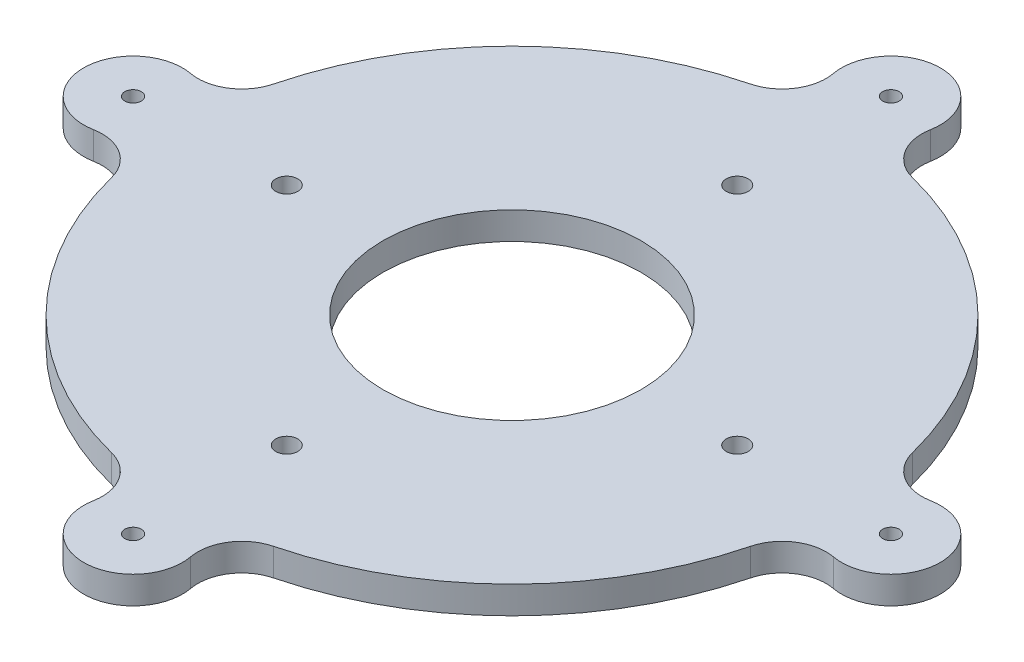
ISO-10303-21;
HEADER;
FILE_DESCRIPTION(('STEP AP214'),'2;1');
FILE_NAME('part.step','',(''),(''),'','','');
FILE_SCHEMA(('AUTOMOTIVE_DESIGN { 1 0 10303 214 1 1 1 1 }'));
ENDSEC;
DATA;
#1=APPLICATION_CONTEXT('core data for automotive mechanical design processes');
#2=APPLICATION_PROTOCOL_DEFINITION('international standard','automotive_design',2000,#1);
#3=PRODUCT_CONTEXT('',#1,'mechanical');
#4=PRODUCT('Part','Part','',(#3));
#5=PRODUCT_RELATED_PRODUCT_CATEGORY('part','',(#4));
#6=PRODUCT_DEFINITION_FORMATION('','',#4);
#7=PRODUCT_DEFINITION_CONTEXT('part definition',#1,'design');
#8=PRODUCT_DEFINITION('design','',#6,#7);
#9=PRODUCT_DEFINITION_SHAPE('','',#8);
#10=(LENGTH_UNIT() NAMED_UNIT(*) SI_UNIT(.MILLI.,.METRE.));
#11=(NAMED_UNIT(*) PLANE_ANGLE_UNIT() SI_UNIT($,.RADIAN.));
#12=(NAMED_UNIT(*) SI_UNIT($,.STERADIAN.) SOLID_ANGLE_UNIT());
#13=UNCERTAINTY_MEASURE_WITH_UNIT(LENGTH_MEASURE(1.E-05),#10,'distance_accuracy_value','');
#14=(GEOMETRIC_REPRESENTATION_CONTEXT(3) GLOBAL_UNCERTAINTY_ASSIGNED_CONTEXT((#13)) GLOBAL_UNIT_ASSIGNED_CONTEXT((#10,
#11,#12)) REPRESENTATION_CONTEXT('',''));
#15=CARTESIAN_POINT('',(0.,0.,0.));
#16=DIRECTION('',(0.,0.,1.));
#17=DIRECTION('',(1.,0.,0.));
#18=AXIS2_PLACEMENT_3D('',#15,#16,#17);
#19=CARTESIAN_POINT('',(32.9565217391304,5.,8.35868858483333));
#20=DIRECTION('',(0.,1.,0.));
#21=DIRECTION('',(0.,0.,1.));
#22=AXIS2_PLACEMENT_3D('',#19,#20,#21);
#23=PLANE('',#22);
#24=CARTESIAN_POINT('',(0.,5.,41.01219331));
#25=DIRECTION('',(0.,1.,0.));
#26=DIRECTION('',(0.,0.,1.));
#27=AXIS2_PLACEMENT_3D('',#24,#25,#26);
#28=CIRCLE('',#27,2.);
#29=CARTESIAN_POINT('',(0.,5.,43.01219331));
#30=VERTEX_POINT('',#29);
#31=EDGE_CURVE('E367',#30,#30,#28,.T.);
#32=ORIENTED_EDGE('',*,*,#31,.F.);
#33=EDGE_LOOP('',(#32));
#34=FACE_BOUND('',#33,.T.);
#35=CARTESIAN_POINT('',(-41.01219331,5.,0.));
#36=DIRECTION('',(0.,1.,0.));
#37=DIRECTION('',(0.,0.,1.));
#38=AXIS2_PLACEMENT_3D('',#35,#36,#37);
#39=CIRCLE('',#38,2.);
#40=CARTESIAN_POINT('',(-41.01219331,5.,2.));
#41=VERTEX_POINT('',#40);
#42=EDGE_CURVE('E379',#41,#41,#39,.T.);
#43=ORIENTED_EDGE('',*,*,#42,.F.);
#44=EDGE_LOOP('',(#43));
#45=FACE_BOUND('',#44,.T.);
#46=CARTESIAN_POINT('',(0.,5.,69.));
#47=DIRECTION('',(0.,1.,0.));
#48=DIRECTION('',(0.,0.,1.));
#49=AXIS2_PLACEMENT_3D('',#46,#47,#48);
#50=CIRCLE('',#49,1.5);
#51=CARTESIAN_POINT('',(0.,5.,70.5));
#52=VERTEX_POINT('',#51);
#53=EDGE_CURVE('E391',#52,#52,#50,.T.);
#54=ORIENTED_EDGE('',*,*,#53,.F.);
#55=EDGE_LOOP('',(#54));
#56=FACE_BOUND('',#55,.T.);
#57=CARTESIAN_POINT('',(69.,5.,0.));
#58=DIRECTION('',(0.,1.,0.));
#59=DIRECTION('',(0.,0.,1.));
#60=AXIS2_PLACEMENT_3D('',#57,#58,#59);
#61=CIRCLE('',#60,1.5);
#62=CARTESIAN_POINT('',(69.,5.,1.5));
#63=VERTEX_POINT('',#62);
#64=EDGE_CURVE('E403',#63,#63,#61,.T.);
#65=ORIENTED_EDGE('',*,*,#64,.F.);
#66=EDGE_LOOP('',(#65));
#67=FACE_BOUND('',#66,.T.);
#68=CARTESIAN_POINT('',(0.,5.,0.));
#69=DIRECTION('',(0.,1.,0.));
#70=DIRECTION('',(0.,0.,1.));
#71=AXIS2_PLACEMENT_3D('',#68,#69,#70);
#72=CIRCLE('',#71,60.);
#73=CARTESIAN_POINT('',(14.7506269144118,5.,58.158567774936));
#74=VERTEX_POINT('',#73);
#75=CARTESIAN_POINT('',(58.158567774936,5.,14.7506269144118));
#76=VERTEX_POINT('',#75);
#77=EDGE_CURVE('E213',#74,#76,#72,.T.);
#78=ORIENTED_EDGE('',*,*,#77,.T.);
#79=CARTESIAN_POINT('',(65.9130434782609,5.,16.7173771696667));
#80=DIRECTION('',(0.,-1.,0.));
#81=DIRECTION('',(0.,0.,1.));
#82=AXIS2_PLACEMENT_3D('',#79,#80,#81);
#83=CIRCLE('',#82,8.00000000000001);
#84=CARTESIAN_POINT('',(67.3657289002557,5.,8.85037614864705));
#85=VERTEX_POINT('',#84);
#86=EDGE_CURVE('E121',#76,#85,#83,.T.);
#87=ORIENTED_EDGE('',*,*,#86,.T.);
#88=CARTESIAN_POINT('',(69.,5.,0.));
#89=DIRECTION('',(0.,1.,0.));
#90=DIRECTION('',(0.,0.,1.));
#91=AXIS2_PLACEMENT_3D('',#88,#89,#90);
#92=CIRCLE('',#91,8.99999999999999);
#93=CARTESIAN_POINT('',(67.3657289002557,5.,-8.85037614864705));
#94=VERTEX_POINT('',#93);
#95=EDGE_CURVE('E252',#85,#94,#92,.T.);
#96=ORIENTED_EDGE('',*,*,#95,.T.);
#97=CARTESIAN_POINT('',(65.9130434782609,5.,-16.7173771696667));
#98=DIRECTION('',(0.,-1.,0.));
#99=DIRECTION('',(0.,0.,1.));
#100=AXIS2_PLACEMENT_3D('',#97,#98,#99);
#101=CIRCLE('',#100,8.00000000000001);
#102=CARTESIAN_POINT('',(58.158567774936,5.,-14.7506269144118));
#103=VERTEX_POINT('',#102);
#104=EDGE_CURVE('E271',#94,#103,#101,.T.);
#105=ORIENTED_EDGE('',*,*,#104,.T.);
#106=CARTESIAN_POINT('',(0.,5.,0.));
#107=DIRECTION('',(0.,1.,0.));
#108=DIRECTION('',(0.,0.,1.));
#109=AXIS2_PLACEMENT_3D('',#106,#107,#108);
#110=CIRCLE('',#109,60.);
#111=CARTESIAN_POINT('',(14.7506269144118,5.,-58.158567774936));
#112=VERTEX_POINT('',#111);
#113=EDGE_CURVE('E268',#103,#112,#110,.T.);
#114=ORIENTED_EDGE('',*,*,#113,.T.);
#115=CARTESIAN_POINT('',(16.7173771696667,5.,-65.9130434782609));
#116=DIRECTION('',(0.,-1.,0.));
#117=DIRECTION('',(0.,0.,1.));
#118=AXIS2_PLACEMENT_3D('',#115,#116,#117);
#119=CIRCLE('',#118,8.00000000000001);
#120=CARTESIAN_POINT('',(8.85037614864704,5.,-67.3657289002557));
#121=VERTEX_POINT('',#120);
#122=EDGE_CURVE('E270',#112,#121,#119,.T.);
#123=ORIENTED_EDGE('',*,*,#122,.T.);
#124=CARTESIAN_POINT('',(0.,5.,-69.));
#125=DIRECTION('',(0.,1.,0.));
#126=DIRECTION('',(0.,0.,1.));
#127=AXIS2_PLACEMENT_3D('',#124,#125,#126);
#128=CIRCLE('',#127,9.);
#129=CARTESIAN_POINT('',(-8.85037614864706,5.,-67.3657289002557));
#130=VERTEX_POINT('',#129);
#131=EDGE_CURVE('E273',#121,#130,#128,.T.);
#132=ORIENTED_EDGE('',*,*,#131,.T.);
#133=CARTESIAN_POINT('',(-16.7173771696667,5.,-65.9130434782609));
#134=DIRECTION('',(0.,-1.,0.));
#135=DIRECTION('',(0.,0.,1.));
#136=AXIS2_PLACEMENT_3D('',#133,#134,#135);
#137=CIRCLE('',#136,8.00000000000001);
#138=CARTESIAN_POINT('',(-14.7506269144118,5.,-58.158567774936));
#139=VERTEX_POINT('',#138);
#140=EDGE_CURVE('E279',#130,#139,#137,.T.);
#141=ORIENTED_EDGE('',*,*,#140,.T.);
#142=CARTESIAN_POINT('',(0.,5.,0.));
#143=DIRECTION('',(0.,1.,0.));
#144=DIRECTION('',(0.,0.,1.));
#145=AXIS2_PLACEMENT_3D('',#142,#143,#144);
#146=CIRCLE('',#145,60.);
#147=CARTESIAN_POINT('',(-58.158567774936,5.,-14.7506269144118));
#148=VERTEX_POINT('',#147);
#149=EDGE_CURVE('E281',#139,#148,#146,.T.);
#150=ORIENTED_EDGE('',*,*,#149,.T.);
#151=CARTESIAN_POINT('',(-65.9130434782609,5.,-16.7173771696667));
#152=DIRECTION('',(0.,-1.,0.));
#153=DIRECTION('',(0.,0.,1.));
#154=AXIS2_PLACEMENT_3D('',#151,#152,#153);
#155=CIRCLE('',#154,8.00000000000003);
#156=CARTESIAN_POINT('',(-67.3657289002558,5.,-8.85037614864703));
#157=VERTEX_POINT('',#156);
#158=EDGE_CURVE('E283',#148,#157,#155,.T.);
#159=ORIENTED_EDGE('',*,*,#158,.T.);
#160=CARTESIAN_POINT('',(-69.,5.,0.));
#161=DIRECTION('',(0.,1.,0.));
#162=DIRECTION('',(0.,0.,1.));
#163=AXIS2_PLACEMENT_3D('',#160,#161,#162);
#164=CIRCLE('',#163,8.99999999999998);
#165=CARTESIAN_POINT('',(-67.3657289002557,5.,8.85037614864704));
#166=VERTEX_POINT('',#165);
#167=EDGE_CURVE('E285',#157,#166,#164,.T.);
#168=ORIENTED_EDGE('',*,*,#167,.T.);
#169=CARTESIAN_POINT('',(-65.9130434782609,5.,16.7173771696667));
#170=DIRECTION('',(0.,-1.,0.));
#171=DIRECTION('',(0.,0.,1.));
#172=AXIS2_PLACEMENT_3D('',#169,#170,#171);
#173=CIRCLE('',#172,8.00000000000004);
#174=CARTESIAN_POINT('',(-58.158567774936,5.,14.7506269144118));
#175=VERTEX_POINT('',#174);
#176=EDGE_CURVE('E287',#166,#175,#173,.T.);
#177=ORIENTED_EDGE('',*,*,#176,.T.);
#178=CARTESIAN_POINT('',(0.,5.,0.));
#179=DIRECTION('',(0.,1.,0.));
#180=DIRECTION('',(0.,0.,1.));
#181=AXIS2_PLACEMENT_3D('',#178,#179,#180);
#182=CIRCLE('',#181,60.);
#183=CARTESIAN_POINT('',(-14.7506269144118,5.,58.158567774936));
#184=VERTEX_POINT('',#183);
#185=EDGE_CURVE('E164',#175,#184,#182,.T.);
#186=ORIENTED_EDGE('',*,*,#185,.T.);
#187=CARTESIAN_POINT('',(-16.7173771696667,5.,65.9130434782609));
#188=DIRECTION('',(0.,-1.,0.));
#189=DIRECTION('',(0.,0.,1.));
#190=AXIS2_PLACEMENT_3D('',#187,#188,#189);
#191=CIRCLE('',#190,8.00000000000002);
#192=CARTESIAN_POINT('',(-8.85037614864704,5.,67.3657289002557));
#193=VERTEX_POINT('',#192);
#194=EDGE_CURVE('E158',#184,#193,#191,.T.);
#195=ORIENTED_EDGE('',*,*,#194,.T.);
#196=CARTESIAN_POINT('',(0.,5.,69.));
#197=DIRECTION('',(0.,1.,0.));
#198=DIRECTION('',(0.,0.,1.));
#199=AXIS2_PLACEMENT_3D('',#196,#197,#198);
#200=CIRCLE('',#199,8.99999999999999);
#201=CARTESIAN_POINT('',(8.85037614864704,5.,67.3657289002557));
#202=VERTEX_POINT('',#201);
#203=EDGE_CURVE('E162',#193,#202,#200,.T.);
#204=ORIENTED_EDGE('',*,*,#203,.T.);
#205=CARTESIAN_POINT('',(16.7173771696667,5.,65.9130434782609));
#206=DIRECTION('',(0.,-1.,0.));
#207=DIRECTION('',(0.,0.,1.));
#208=AXIS2_PLACEMENT_3D('',#205,#206,#207);
#209=CIRCLE('',#208,8.00000000000002);
#210=EDGE_CURVE('E54',#202,#74,#209,.T.);
#211=ORIENTED_EDGE('',*,*,#210,.T.);
#212=EDGE_LOOP('',(#78,#87,#96,#105,#114,#123,#132,#141,#150,#159,#168,#177,#186,#195,#204,#211));
#213=FACE_BOUND('',#212,.T.);
#214=CARTESIAN_POINT('',(0.,5.,0.));
#215=DIRECTION('',(0.,1.,0.));
#216=DIRECTION('',(0.,0.,1.));
#217=AXIS2_PLACEMENT_3D('',#214,#215,#216);
#218=CIRCLE('',#217,23.5);
#219=CARTESIAN_POINT('',(0.,5.,23.5));
#220=VERTEX_POINT('',#219);
#221=EDGE_CURVE('E186',#220,#220,#218,.T.);
#222=ORIENTED_EDGE('',*,*,#221,.F.);
#223=EDGE_LOOP('',(#222));
#224=FACE_BOUND('',#223,.T.);
#225=CARTESIAN_POINT('',(0.,5.,-69.));
#226=DIRECTION('',(0.,1.,0.));
#227=DIRECTION('',(0.,0.,1.));
#228=AXIS2_PLACEMENT_3D('',#225,#226,#227);
#229=CIRCLE('',#228,1.5);
#230=CARTESIAN_POINT('',(0.,5.,-67.5));
#231=VERTEX_POINT('',#230);
#232=EDGE_CURVE('E397',#231,#231,#229,.T.);
#233=ORIENTED_EDGE('',*,*,#232,.F.);
#234=EDGE_LOOP('',(#233));
#235=FACE_BOUND('',#234,.T.);
#236=CARTESIAN_POINT('',(0.,5.,-41.01219331));
#237=DIRECTION('',(0.,1.,0.));
#238=DIRECTION('',(0.,0.,1.));
#239=AXIS2_PLACEMENT_3D('',#236,#237,#238);
#240=CIRCLE('',#239,2.00000000000001);
#241=CARTESIAN_POINT('',(0.,5.,-39.01219331));
#242=VERTEX_POINT('',#241);
#243=EDGE_CURVE('E385',#242,#242,#240,.T.);
#244=ORIENTED_EDGE('',*,*,#243,.F.);
#245=EDGE_LOOP('',(#244));
#246=FACE_BOUND('',#245,.T.);
#247=CARTESIAN_POINT('',(41.01219331,5.,0.));
#248=DIRECTION('',(0.,1.,0.));
#249=DIRECTION('',(0.,0.,1.));
#250=AXIS2_PLACEMENT_3D('',#247,#248,#249);
#251=CIRCLE('',#250,2.);
#252=CARTESIAN_POINT('',(41.01219331,5.,2.));
#253=VERTEX_POINT('',#252);
#254=EDGE_CURVE('E373',#253,#253,#251,.T.);
#255=ORIENTED_EDGE('',*,*,#254,.F.);
#256=EDGE_LOOP('',(#255));
#257=FACE_BOUND('',#256,.T.);
#258=CARTESIAN_POINT('',(-69.,5.,0.));
#259=DIRECTION('',(0.,1.,0.));
#260=DIRECTION('',(0.,0.,1.));
#261=AXIS2_PLACEMENT_3D('',#258,#259,#260);
#262=CIRCLE('',#261,1.5);
#263=CARTESIAN_POINT('',(-69.,5.,1.5));
#264=VERTEX_POINT('',#263);
#265=EDGE_CURVE('E358',#264,#264,#262,.T.);
#266=ORIENTED_EDGE('',*,*,#265,.F.);
#267=EDGE_LOOP('',(#266));
#268=FACE_BOUND('',#267,.T.);
#269=ADVANCED_FACE('F37',(#34,#45,#56,#67,#213,#224,#235,#246,#257,#268),#23,.T.);
#270=CARTESIAN_POINT('',(32.9565217391304,0.,8.35868858483333));
#271=DIRECTION('',(0.,1.,0.));
#272=DIRECTION('',(0.,0.,1.));
#273=AXIS2_PLACEMENT_3D('',#270,#271,#272);
#274=PLANE('',#273);
#275=CARTESIAN_POINT('',(0.,0.,0.));
#276=DIRECTION('',(0.,1.,0.));
#277=DIRECTION('',(0.,0.,1.));
#278=AXIS2_PLACEMENT_3D('',#275,#276,#277);
#279=CIRCLE('',#278,60.);
#280=CARTESIAN_POINT('',(14.7506269144118,0.,58.158567774936));
#281=VERTEX_POINT('',#280);
#282=CARTESIAN_POINT('',(58.158567774936,0.,14.7506269144118));
#283=VERTEX_POINT('',#282);
#284=EDGE_CURVE('E182',#281,#283,#279,.T.);
#285=ORIENTED_EDGE('',*,*,#284,.F.);
#286=CARTESIAN_POINT('',(16.7173771696667,0.,65.9130434782609));
#287=DIRECTION('',(0.,-1.,0.));
#288=DIRECTION('',(0.,0.,1.));
#289=AXIS2_PLACEMENT_3D('',#286,#287,#288);
#290=CIRCLE('',#289,8.00000000000002);
#291=CARTESIAN_POINT('',(8.85037614864704,0.,67.3657289002557));
#292=VERTEX_POINT('',#291);
#293=EDGE_CURVE('E113',#292,#281,#290,.T.);
#294=ORIENTED_EDGE('',*,*,#293,.F.);
#295=CARTESIAN_POINT('',(0.,0.,69.));
#296=DIRECTION('',(0.,1.,0.));
#297=DIRECTION('',(0.,0.,1.));
#298=AXIS2_PLACEMENT_3D('',#295,#296,#297);
#299=CIRCLE('',#298,8.99999999999999);
#300=CARTESIAN_POINT('',(-8.85037614864704,0.,67.3657289002557));
#301=VERTEX_POINT('',#300);
#302=EDGE_CURVE('E107',#301,#292,#299,.T.);
#303=ORIENTED_EDGE('',*,*,#302,.F.);
#304=CARTESIAN_POINT('',(-16.7173771696667,0.,65.9130434782609));
#305=DIRECTION('',(0.,-1.,0.));
#306=DIRECTION('',(0.,0.,1.));
#307=AXIS2_PLACEMENT_3D('',#304,#305,#306);
#308=CIRCLE('',#307,8.00000000000002);
#309=CARTESIAN_POINT('',(-14.7506269144118,0.,58.158567774936));
#310=VERTEX_POINT('',#309);
#311=EDGE_CURVE('E172',#310,#301,#308,.T.);
#312=ORIENTED_EDGE('',*,*,#311,.F.);
#313=CARTESIAN_POINT('',(0.,0.,0.));
#314=DIRECTION('',(0.,1.,0.));
#315=DIRECTION('',(0.,0.,1.));
#316=AXIS2_PLACEMENT_3D('',#313,#314,#315);
#317=CIRCLE('',#316,60.);
#318=CARTESIAN_POINT('',(-58.158567774936,0.,14.7506269144118));
#319=VERTEX_POINT('',#318);
#320=EDGE_CURVE('E208',#319,#310,#317,.T.);
#321=ORIENTED_EDGE('',*,*,#320,.F.);
#322=CARTESIAN_POINT('',(-65.9130434782609,0.,16.7173771696667));
#323=DIRECTION('',(0.,-1.,0.));
#324=DIRECTION('',(0.,0.,1.));
#325=AXIS2_PLACEMENT_3D('',#322,#323,#324);
#326=CIRCLE('',#325,8.00000000000004);
#327=CARTESIAN_POINT('',(-67.3657289002557,0.,8.85037614864704));
#328=VERTEX_POINT('',#327);
#329=EDGE_CURVE('E206',#328,#319,#326,.T.);
#330=ORIENTED_EDGE('',*,*,#329,.F.);
#331=CARTESIAN_POINT('',(-69.,0.,0.));
#332=DIRECTION('',(0.,1.,0.));
#333=DIRECTION('',(0.,0.,1.));
#334=AXIS2_PLACEMENT_3D('',#331,#332,#333);
#335=CIRCLE('',#334,8.99999999999998);
#336=CARTESIAN_POINT('',(-67.3657289002558,0.,-8.85037614864703));
#337=VERTEX_POINT('',#336);
#338=EDGE_CURVE('E204',#337,#328,#335,.T.);
#339=ORIENTED_EDGE('',*,*,#338,.F.);
#340=CARTESIAN_POINT('',(-65.9130434782609,0.,-16.7173771696667));
#341=DIRECTION('',(0.,-1.,0.));
#342=DIRECTION('',(0.,0.,1.));
#343=AXIS2_PLACEMENT_3D('',#340,#341,#342);
#344=CIRCLE('',#343,8.00000000000003);
#345=CARTESIAN_POINT('',(-58.158567774936,0.,-14.7506269144118));
#346=VERTEX_POINT('',#345);
#347=EDGE_CURVE('E202',#346,#337,#344,.T.);
#348=ORIENTED_EDGE('',*,*,#347,.F.);
#349=CARTESIAN_POINT('',(0.,0.,0.));
#350=DIRECTION('',(0.,1.,0.));
#351=DIRECTION('',(0.,0.,1.));
#352=AXIS2_PLACEMENT_3D('',#349,#350,#351);
#353=CIRCLE('',#352,60.);
#354=CARTESIAN_POINT('',(-14.7506269144118,0.,-58.158567774936));
#355=VERTEX_POINT('',#354);
#356=EDGE_CURVE('E200',#355,#346,#353,.T.);
#357=ORIENTED_EDGE('',*,*,#356,.F.);
#358=CARTESIAN_POINT('',(-16.7173771696667,0.,-65.9130434782609));
#359=DIRECTION('',(0.,-1.,0.));
#360=DIRECTION('',(0.,0.,1.));
#361=AXIS2_PLACEMENT_3D('',#358,#359,#360);
#362=CIRCLE('',#361,8.00000000000001);
#363=CARTESIAN_POINT('',(-8.85037614864706,0.,-67.3657289002557));
#364=VERTEX_POINT('',#363);
#365=EDGE_CURVE('E198',#364,#355,#362,.T.);
#366=ORIENTED_EDGE('',*,*,#365,.F.);
#367=CARTESIAN_POINT('',(0.,0.,-69.));
#368=DIRECTION('',(0.,1.,0.));
#369=DIRECTION('',(0.,0.,1.));
#370=AXIS2_PLACEMENT_3D('',#367,#368,#369);
#371=CIRCLE('',#370,9.);
#372=CARTESIAN_POINT('',(8.85037614864704,0.,-67.3657289002557));
#373=VERTEX_POINT('',#372);
#374=EDGE_CURVE('E196',#373,#364,#371,.T.);
#375=ORIENTED_EDGE('',*,*,#374,.F.);
#376=CARTESIAN_POINT('',(16.7173771696667,0.,-65.9130434782609));
#377=DIRECTION('',(0.,-1.,0.));
#378=DIRECTION('',(0.,0.,1.));
#379=AXIS2_PLACEMENT_3D('',#376,#377,#378);
#380=CIRCLE('',#379,8.00000000000001);
#381=CARTESIAN_POINT('',(14.7506269144118,0.,-58.158567774936));
#382=VERTEX_POINT('',#381);
#383=EDGE_CURVE('E194',#382,#373,#380,.T.);
#384=ORIENTED_EDGE('',*,*,#383,.F.);
#385=CARTESIAN_POINT('',(0.,0.,0.));
#386=DIRECTION('',(0.,1.,0.));
#387=DIRECTION('',(0.,0.,1.));
#388=AXIS2_PLACEMENT_3D('',#385,#386,#387);
#389=CIRCLE('',#388,60.);
#390=CARTESIAN_POINT('',(58.158567774936,0.,-14.7506269144118));
#391=VERTEX_POINT('',#390);
#392=EDGE_CURVE('E192',#391,#382,#389,.T.);
#393=ORIENTED_EDGE('',*,*,#392,.F.);
#394=CARTESIAN_POINT('',(65.9130434782609,0.,-16.7173771696667));
#395=DIRECTION('',(0.,-1.,0.));
#396=DIRECTION('',(0.,0.,1.));
#397=AXIS2_PLACEMENT_3D('',#394,#395,#396);
#398=CIRCLE('',#397,8.00000000000001);
#399=CARTESIAN_POINT('',(67.3657289002557,0.,-8.85037614864705));
#400=VERTEX_POINT('',#399);
#401=EDGE_CURVE('E190',#400,#391,#398,.T.);
#402=ORIENTED_EDGE('',*,*,#401,.F.);
#403=CARTESIAN_POINT('',(69.,0.,0.));
#404=DIRECTION('',(0.,1.,0.));
#405=DIRECTION('',(0.,0.,1.));
#406=AXIS2_PLACEMENT_3D('',#403,#404,#405);
#407=CIRCLE('',#406,8.99999999999999);
#408=CARTESIAN_POINT('',(67.3657289002557,0.,8.85037614864705));
#409=VERTEX_POINT('',#408);
#410=EDGE_CURVE('E188',#409,#400,#407,.T.);
#411=ORIENTED_EDGE('',*,*,#410,.F.);
#412=CARTESIAN_POINT('',(65.9130434782609,0.,16.7173771696667));
#413=DIRECTION('',(0.,-1.,0.));
#414=DIRECTION('',(0.,0.,1.));
#415=AXIS2_PLACEMENT_3D('',#412,#413,#414);
#416=CIRCLE('',#415,8.00000000000001);
#417=EDGE_CURVE('E185',#283,#409,#416,.T.);
#418=ORIENTED_EDGE('',*,*,#417,.F.);
#419=EDGE_LOOP('',(#285,#294,#303,#312,#321,#330,#339,#348,#357,#366,#375,#384,#393,#402,#411,#418));
#420=FACE_BOUND('',#419,.T.);
#421=CARTESIAN_POINT('',(0.,0.,0.));
#422=DIRECTION('',(0.,1.,0.));
#423=DIRECTION('',(0.,0.,1.));
#424=AXIS2_PLACEMENT_3D('',#421,#422,#423);
#425=CIRCLE('',#424,23.5);
#426=CARTESIAN_POINT('',(0.,0.,23.5));
#427=VERTEX_POINT('',#426);
#428=EDGE_CURVE('E406',#427,#427,#425,.T.);
#429=ORIENTED_EDGE('',*,*,#428,.T.);
#430=EDGE_LOOP('',(#429));
#431=FACE_BOUND('',#430,.T.);
#432=CARTESIAN_POINT('',(69.,0.,0.));
#433=DIRECTION('',(0.,1.,0.));
#434=DIRECTION('',(0.,0.,1.));
#435=AXIS2_PLACEMENT_3D('',#432,#433,#434);
#436=CIRCLE('',#435,1.5);
#437=CARTESIAN_POINT('',(69.,0.,1.5));
#438=VERTEX_POINT('',#437);
#439=EDGE_CURVE('E400',#438,#438,#436,.T.);
#440=ORIENTED_EDGE('',*,*,#439,.T.);
#441=EDGE_LOOP('',(#440));
#442=FACE_BOUND('',#441,.T.);
#443=CARTESIAN_POINT('',(0.,0.,-69.));
#444=DIRECTION('',(0.,1.,0.));
#445=DIRECTION('',(0.,0.,1.));
#446=AXIS2_PLACEMENT_3D('',#443,#444,#445);
#447=CIRCLE('',#446,1.5);
#448=CARTESIAN_POINT('',(0.,0.,-67.5));
#449=VERTEX_POINT('',#448);
#450=EDGE_CURVE('E394',#449,#449,#447,.T.);
#451=ORIENTED_EDGE('',*,*,#450,.T.);
#452=EDGE_LOOP('',(#451));
#453=FACE_BOUND('',#452,.T.);
#454=CARTESIAN_POINT('',(0.,0.,69.));
#455=DIRECTION('',(0.,1.,0.));
#456=DIRECTION('',(0.,0.,1.));
#457=AXIS2_PLACEMENT_3D('',#454,#455,#456);
#458=CIRCLE('',#457,1.5);
#459=CARTESIAN_POINT('',(0.,0.,70.5));
#460=VERTEX_POINT('',#459);
#461=EDGE_CURVE('E388',#460,#460,#458,.T.);
#462=ORIENTED_EDGE('',*,*,#461,.T.);
#463=EDGE_LOOP('',(#462));
#464=FACE_BOUND('',#463,.T.);
#465=CARTESIAN_POINT('',(0.,0.,-41.01219331));
#466=DIRECTION('',(0.,1.,0.));
#467=DIRECTION('',(0.,0.,1.));
#468=AXIS2_PLACEMENT_3D('',#465,#466,#467);
#469=CIRCLE('',#468,2.00000000000001);
#470=CARTESIAN_POINT('',(0.,0.,-39.01219331));
#471=VERTEX_POINT('',#470);
#472=EDGE_CURVE('E382',#471,#471,#469,.T.);
#473=ORIENTED_EDGE('',*,*,#472,.T.);
#474=EDGE_LOOP('',(#473));
#475=FACE_BOUND('',#474,.T.);
#476=CARTESIAN_POINT('',(-41.01219331,0.,0.));
#477=DIRECTION('',(0.,1.,0.));
#478=DIRECTION('',(0.,0.,1.));
#479=AXIS2_PLACEMENT_3D('',#476,#477,#478);
#480=CIRCLE('',#479,2.);
#481=CARTESIAN_POINT('',(-41.01219331,0.,2.));
#482=VERTEX_POINT('',#481);
#483=EDGE_CURVE('E376',#482,#482,#480,.T.);
#484=ORIENTED_EDGE('',*,*,#483,.T.);
#485=EDGE_LOOP('',(#484));
#486=FACE_BOUND('',#485,.T.);
#487=CARTESIAN_POINT('',(41.01219331,0.,0.));
#488=DIRECTION('',(0.,1.,0.));
#489=DIRECTION('',(0.,0.,1.));
#490=AXIS2_PLACEMENT_3D('',#487,#488,#489);
#491=CIRCLE('',#490,2.);
#492=CARTESIAN_POINT('',(41.01219331,0.,2.));
#493=VERTEX_POINT('',#492);
#494=EDGE_CURVE('E370',#493,#493,#491,.T.);
#495=ORIENTED_EDGE('',*,*,#494,.T.);
#496=EDGE_LOOP('',(#495));
#497=FACE_BOUND('',#496,.T.);
#498=CARTESIAN_POINT('',(0.,0.,41.01219331));
#499=DIRECTION('',(0.,1.,0.));
#500=DIRECTION('',(0.,0.,1.));
#501=AXIS2_PLACEMENT_3D('',#498,#499,#500);
#502=CIRCLE('',#501,2.);
#503=CARTESIAN_POINT('',(0.,0.,43.01219331));
#504=VERTEX_POINT('',#503);
#505=EDGE_CURVE('E364',#504,#504,#502,.T.);
#506=ORIENTED_EDGE('',*,*,#505,.T.);
#507=EDGE_LOOP('',(#506));
#508=FACE_BOUND('',#507,.T.);
#509=CARTESIAN_POINT('',(-69.,0.,0.));
#510=DIRECTION('',(0.,1.,0.));
#511=DIRECTION('',(0.,0.,1.));
#512=AXIS2_PLACEMENT_3D('',#509,#510,#511);
#513=CIRCLE('',#512,1.5);
#514=CARTESIAN_POINT('',(-69.,0.,1.5));
#515=VERTEX_POINT('',#514);
#516=EDGE_CURVE('E361',#515,#515,#513,.T.);
#517=ORIENTED_EDGE('',*,*,#516,.T.);
#518=EDGE_LOOP('',(#517));
#519=FACE_BOUND('',#518,.T.);
#520=ADVANCED_FACE('F256',(#420,#431,#442,#453,#464,#475,#486,#497,#508,#519),#274,.F.);
#521=CARTESIAN_POINT('',(0.,5.,0.));
#522=DIRECTION('',(0.,-1.,0.));
#523=DIRECTION('',(0.,0.,-1.));
#524=AXIS2_PLACEMENT_3D('',#521,#522,#523);
#525=CYLINDRICAL_SURFACE('',#524,60.);
#526=ORIENTED_EDGE('',*,*,#284,.T.);
#527=DIRECTION('',(0.,-1.,0.));
#528=VECTOR('',#527,1.);
#529=CARTESIAN_POINT('',(58.158567774936,5.,14.7506269144118));
#530=LINE('',#529,#528);
#531=EDGE_CURVE('E11',#76,#283,#530,.T.);
#532=ORIENTED_EDGE('',*,*,#531,.F.);
#533=ORIENTED_EDGE('',*,*,#77,.F.);
#534=DIRECTION('',(0.,-1.,0.));
#535=VECTOR('',#534,1.);
#536=CARTESIAN_POINT('',(14.7506269144118,5.,58.158567774936));
#537=LINE('',#536,#535);
#538=EDGE_CURVE('E178',#74,#281,#537,.T.);
#539=ORIENTED_EDGE('',*,*,#538,.T.);
#540=EDGE_LOOP('',(#526,#532,#533,#539));
#541=FACE_BOUND('',#540,.T.);
#542=ADVANCED_FACE('F39',(#541),#525,.T.);
#543=CARTESIAN_POINT('',(65.9130434782609,5.,16.7173771696667));
#544=DIRECTION('',(0.,-1.,0.));
#545=DIRECTION('',(0.,0.,-1.));
#546=AXIS2_PLACEMENT_3D('',#543,#544,#545);
#547=CYLINDRICAL_SURFACE('',#546,8.00000000000001);
#548=ORIENTED_EDGE('',*,*,#417,.T.);
#549=DIRECTION('',(0.,-1.,0.));
#550=VECTOR('',#549,1.);
#551=CARTESIAN_POINT('',(67.3657289002557,5.,8.85037614864705));
#552=LINE('',#551,#550);
#553=EDGE_CURVE('E46',#85,#409,#552,.T.);
#554=ORIENTED_EDGE('',*,*,#553,.F.);
#555=ORIENTED_EDGE('',*,*,#86,.F.);
#556=ORIENTED_EDGE('',*,*,#531,.T.);
#557=EDGE_LOOP('',(#548,#554,#555,#556));
#558=FACE_BOUND('',#557,.T.);
#559=ADVANCED_FACE('F615',(#558),#547,.F.);
#560=CARTESIAN_POINT('',(69.,5.,0.));
#561=DIRECTION('',(0.,-1.,0.));
#562=DIRECTION('',(0.,0.,-1.));
#563=AXIS2_PLACEMENT_3D('',#560,#561,#562);
#564=CYLINDRICAL_SURFACE('',#563,8.99999999999999);
#565=ORIENTED_EDGE('',*,*,#410,.T.);
#566=DIRECTION('',(0.,-1.,0.));
#567=VECTOR('',#566,1.);
#568=CARTESIAN_POINT('',(67.3657289002557,5.,-8.85037614864705));
#569=LINE('',#568,#567);
#570=EDGE_CURVE('E244',#94,#400,#569,.T.);
#571=ORIENTED_EDGE('',*,*,#570,.F.);
#572=ORIENTED_EDGE('',*,*,#95,.F.);
#573=ORIENTED_EDGE('',*,*,#553,.T.);
#574=EDGE_LOOP('',(#565,#571,#572,#573));
#575=FACE_BOUND('',#574,.T.);
#576=ADVANCED_FACE('F250',(#575),#564,.T.);
#577=CARTESIAN_POINT('',(65.9130434782609,5.,-16.7173771696667));
#578=DIRECTION('',(0.,-1.,0.));
#579=DIRECTION('',(0.,0.,-1.));
#580=AXIS2_PLACEMENT_3D('',#577,#578,#579);
#581=CYLINDRICAL_SURFACE('',#580,8.00000000000001);
#582=ORIENTED_EDGE('',*,*,#401,.T.);
#583=DIRECTION('',(0.,-1.,0.));
#584=VECTOR('',#583,1.);
#585=CARTESIAN_POINT('',(58.158567774936,5.,-14.7506269144118));
#586=LINE('',#585,#584);
#587=EDGE_CURVE('E241',#103,#391,#586,.T.);
#588=ORIENTED_EDGE('',*,*,#587,.F.);
#589=ORIENTED_EDGE('',*,*,#104,.F.);
#590=ORIENTED_EDGE('',*,*,#570,.T.);
#591=EDGE_LOOP('',(#582,#588,#589,#590));
#592=FACE_BOUND('',#591,.T.);
#593=ADVANCED_FACE('F262',(#592),#581,.F.);
#594=CARTESIAN_POINT('',(0.,5.,0.));
#595=DIRECTION('',(0.,-1.,0.));
#596=DIRECTION('',(0.,0.,-1.));
#597=AXIS2_PLACEMENT_3D('',#594,#595,#596);
#598=CYLINDRICAL_SURFACE('',#597,60.);
#599=ORIENTED_EDGE('',*,*,#392,.T.);
#600=DIRECTION('',(0.,-1.,0.));
#601=VECTOR('',#600,1.);
#602=CARTESIAN_POINT('',(14.7506269144118,5.,-58.158567774936));
#603=LINE('',#602,#601);
#604=EDGE_CURVE('E238',#112,#382,#603,.T.);
#605=ORIENTED_EDGE('',*,*,#604,.F.);
#606=ORIENTED_EDGE('',*,*,#113,.F.);
#607=ORIENTED_EDGE('',*,*,#587,.T.);
#608=EDGE_LOOP('',(#599,#605,#606,#607));
#609=FACE_BOUND('',#608,.T.);
#610=ADVANCED_FACE('F266',(#609),#598,.T.);
#611=CARTESIAN_POINT('',(16.7173771696667,5.,-65.9130434782609));
#612=DIRECTION('',(0.,-1.,0.));
#613=DIRECTION('',(0.,0.,-1.));
#614=AXIS2_PLACEMENT_3D('',#611,#612,#613);
#615=CYLINDRICAL_SURFACE('',#614,8.00000000000001);
#616=ORIENTED_EDGE('',*,*,#383,.T.);
#617=DIRECTION('',(0.,-1.,0.));
#618=VECTOR('',#617,1.);
#619=CARTESIAN_POINT('',(8.85037614864704,5.,-67.3657289002557));
#620=LINE('',#619,#618);
#621=EDGE_CURVE('E235',#121,#373,#620,.T.);
#622=ORIENTED_EDGE('',*,*,#621,.F.);
#623=ORIENTED_EDGE('',*,*,#122,.F.);
#624=ORIENTED_EDGE('',*,*,#604,.T.);
#625=EDGE_LOOP('',(#616,#622,#623,#624));
#626=FACE_BOUND('',#625,.T.);
#627=ADVANCED_FACE('F576',(#626),#615,.F.);
#628=CARTESIAN_POINT('',(0.,5.,-69.));
#629=DIRECTION('',(0.,-1.,0.));
#630=DIRECTION('',(0.,0.,-1.));
#631=AXIS2_PLACEMENT_3D('',#628,#629,#630);
#632=CYLINDRICAL_SURFACE('',#631,9.);
#633=ORIENTED_EDGE('',*,*,#374,.T.);
#634=DIRECTION('',(0.,-1.,0.));
#635=VECTOR('',#634,1.);
#636=CARTESIAN_POINT('',(-8.85037614864706,5.,-67.3657289002557));
#637=LINE('',#636,#635);
#638=EDGE_CURVE('E232',#130,#364,#637,.T.);
#639=ORIENTED_EDGE('',*,*,#638,.F.);
#640=ORIENTED_EDGE('',*,*,#131,.F.);
#641=ORIENTED_EDGE('',*,*,#621,.T.);
#642=EDGE_LOOP('',(#633,#639,#640,#641));
#643=FACE_BOUND('',#642,.T.);
#644=ADVANCED_FACE('F565',(#643),#632,.T.);
#645=CARTESIAN_POINT('',(-16.7173771696667,5.,-65.9130434782609));
#646=DIRECTION('',(0.,-1.,0.));
#647=DIRECTION('',(0.,0.,-1.));
#648=AXIS2_PLACEMENT_3D('',#645,#646,#647);
#649=CYLINDRICAL_SURFACE('',#648,8.00000000000001);
#650=ORIENTED_EDGE('',*,*,#365,.T.);
#651=DIRECTION('',(0.,-1.,0.));
#652=VECTOR('',#651,1.);
#653=CARTESIAN_POINT('',(-14.7506269144118,5.,-58.158567774936));
#654=LINE('',#653,#652);
#655=EDGE_CURVE('E229',#139,#355,#654,.T.);
#656=ORIENTED_EDGE('',*,*,#655,.F.);
#657=ORIENTED_EDGE('',*,*,#140,.F.);
#658=ORIENTED_EDGE('',*,*,#638,.T.);
#659=EDGE_LOOP('',(#650,#656,#657,#658));
#660=FACE_BOUND('',#659,.T.);
#661=ADVANCED_FACE('F554',(#660),#649,.F.);
#662=CARTESIAN_POINT('',(0.,5.,0.));
#663=DIRECTION('',(0.,-1.,0.));
#664=DIRECTION('',(0.,0.,-1.));
#665=AXIS2_PLACEMENT_3D('',#662,#663,#664);
#666=CYLINDRICAL_SURFACE('',#665,60.);
#667=ORIENTED_EDGE('',*,*,#356,.T.);
#668=DIRECTION('',(0.,-1.,0.));
#669=VECTOR('',#668,1.);
#670=CARTESIAN_POINT('',(-58.158567774936,5.,-14.7506269144118));
#671=LINE('',#670,#669);
#672=EDGE_CURVE('E226',#148,#346,#671,.T.);
#673=ORIENTED_EDGE('',*,*,#672,.F.);
#674=ORIENTED_EDGE('',*,*,#149,.F.);
#675=ORIENTED_EDGE('',*,*,#655,.T.);
#676=EDGE_LOOP('',(#667,#673,#674,#675));
#677=FACE_BOUND('',#676,.T.);
#678=ADVANCED_FACE('F543',(#677),#666,.T.);
#679=CARTESIAN_POINT('',(-65.9130434782609,5.,-16.7173771696667));
#680=DIRECTION('',(0.,-1.,0.));
#681=DIRECTION('',(0.,0.,-1.));
#682=AXIS2_PLACEMENT_3D('',#679,#680,#681);
#683=CYLINDRICAL_SURFACE('',#682,8.00000000000003);
#684=ORIENTED_EDGE('',*,*,#347,.T.);
#685=DIRECTION('',(0.,-1.,0.));
#686=VECTOR('',#685,1.);
#687=CARTESIAN_POINT('',(-67.3657289002558,5.,-8.85037614864703));
#688=LINE('',#687,#686);
#689=EDGE_CURVE('E223',#157,#337,#688,.T.);
#690=ORIENTED_EDGE('',*,*,#689,.F.);
#691=ORIENTED_EDGE('',*,*,#158,.F.);
#692=ORIENTED_EDGE('',*,*,#672,.T.);
#693=EDGE_LOOP('',(#684,#690,#691,#692));
#694=FACE_BOUND('',#693,.T.);
#695=ADVANCED_FACE('F532',(#694),#683,.F.);
#696=CARTESIAN_POINT('',(-69.,5.,0.));
#697=DIRECTION('',(0.,-1.,0.));
#698=DIRECTION('',(0.,0.,-1.));
#699=AXIS2_PLACEMENT_3D('',#696,#697,#698);
#700=CYLINDRICAL_SURFACE('',#699,8.99999999999998);
#701=ORIENTED_EDGE('',*,*,#338,.T.);
#702=DIRECTION('',(0.,-1.,0.));
#703=VECTOR('',#702,1.);
#704=CARTESIAN_POINT('',(-67.3657289002557,5.,8.85037614864704));
#705=LINE('',#704,#703);
#706=EDGE_CURVE('E220',#166,#328,#705,.T.);
#707=ORIENTED_EDGE('',*,*,#706,.F.);
#708=ORIENTED_EDGE('',*,*,#167,.F.);
#709=ORIENTED_EDGE('',*,*,#689,.T.);
#710=EDGE_LOOP('',(#701,#707,#708,#709));
#711=FACE_BOUND('',#710,.T.);
#712=ADVANCED_FACE('F522',(#711),#700,.T.);
#713=CARTESIAN_POINT('',(-65.9130434782609,5.,16.7173771696667));
#714=DIRECTION('',(0.,-1.,0.));
#715=DIRECTION('',(0.,0.,-1.));
#716=AXIS2_PLACEMENT_3D('',#713,#714,#715);
#717=CYLINDRICAL_SURFACE('',#716,8.00000000000004);
#718=ORIENTED_EDGE('',*,*,#329,.T.);
#719=DIRECTION('',(0.,-1.,0.));
#720=VECTOR('',#719,1.);
#721=CARTESIAN_POINT('',(-58.158567774936,5.,14.7506269144118));
#722=LINE('',#721,#720);
#723=EDGE_CURVE('E217',#175,#319,#722,.T.);
#724=ORIENTED_EDGE('',*,*,#723,.F.);
#725=ORIENTED_EDGE('',*,*,#176,.F.);
#726=ORIENTED_EDGE('',*,*,#706,.T.);
#727=EDGE_LOOP('',(#718,#724,#725,#726));
#728=FACE_BOUND('',#727,.T.);
#729=ADVANCED_FACE('F293',(#728),#717,.F.);
#730=CARTESIAN_POINT('',(0.,5.,0.));
#731=DIRECTION('',(0.,-1.,0.));
#732=DIRECTION('',(0.,0.,-1.));
#733=AXIS2_PLACEMENT_3D('',#730,#731,#732);
#734=CYLINDRICAL_SURFACE('',#733,60.);
#735=ORIENTED_EDGE('',*,*,#320,.T.);
#736=DIRECTION('',(0.,-1.,0.));
#737=VECTOR('',#736,1.);
#738=CARTESIAN_POINT('',(-14.7506269144118,5.,58.158567774936));
#739=LINE('',#738,#737);
#740=EDGE_CURVE('E173',#184,#310,#739,.T.);
#741=ORIENTED_EDGE('',*,*,#740,.F.);
#742=ORIENTED_EDGE('',*,*,#185,.F.);
#743=ORIENTED_EDGE('',*,*,#723,.T.);
#744=EDGE_LOOP('',(#735,#741,#742,#743));
#745=FACE_BOUND('',#744,.T.);
#746=ADVANCED_FACE('F297',(#745),#734,.T.);
#747=CARTESIAN_POINT('',(-16.7173771696667,5.,65.9130434782609));
#748=DIRECTION('',(0.,-1.,0.));
#749=DIRECTION('',(0.,0.,-1.));
#750=AXIS2_PLACEMENT_3D('',#747,#748,#749);
#751=CYLINDRICAL_SURFACE('',#750,8.00000000000002);
#752=ORIENTED_EDGE('',*,*,#311,.T.);
#753=DIRECTION('',(0.,-1.,0.));
#754=VECTOR('',#753,1.);
#755=CARTESIAN_POINT('',(-8.85037614864704,5.,67.3657289002557));
#756=LINE('',#755,#754);
#757=EDGE_CURVE('E169',#193,#301,#756,.T.);
#758=ORIENTED_EDGE('',*,*,#757,.F.);
#759=ORIENTED_EDGE('',*,*,#194,.F.);
#760=ORIENTED_EDGE('',*,*,#740,.T.);
#761=EDGE_LOOP('',(#752,#758,#759,#760));
#762=FACE_BOUND('',#761,.T.);
#763=ADVANCED_FACE('F170',(#762),#751,.F.);
#764=CARTESIAN_POINT('',(0.,5.,69.));
#765=DIRECTION('',(0.,-1.,0.));
#766=DIRECTION('',(0.,0.,-1.));
#767=AXIS2_PLACEMENT_3D('',#764,#765,#766);
#768=CYLINDRICAL_SURFACE('',#767,8.99999999999999);
#769=ORIENTED_EDGE('',*,*,#302,.T.);
#770=DIRECTION('',(0.,-1.,0.));
#771=VECTOR('',#770,1.);
#772=CARTESIAN_POINT('',(8.85037614864704,5.,67.3657289002557));
#773=LINE('',#772,#771);
#774=EDGE_CURVE('E174',#202,#292,#773,.T.);
#775=ORIENTED_EDGE('',*,*,#774,.F.);
#776=ORIENTED_EDGE('',*,*,#203,.F.);
#777=ORIENTED_EDGE('',*,*,#757,.T.);
#778=EDGE_LOOP('',(#769,#775,#776,#777));
#779=FACE_BOUND('',#778,.T.);
#780=ADVANCED_FACE('F176',(#779),#768,.T.);
#781=CARTESIAN_POINT('',(16.7173771696667,5.,65.9130434782609));
#782=DIRECTION('',(0.,-1.,0.));
#783=DIRECTION('',(0.,0.,-1.));
#784=AXIS2_PLACEMENT_3D('',#781,#782,#783);
#785=CYLINDRICAL_SURFACE('',#784,8.00000000000002);
#786=ORIENTED_EDGE('',*,*,#293,.T.);
#787=ORIENTED_EDGE('',*,*,#538,.F.);
#788=ORIENTED_EDGE('',*,*,#210,.F.);
#789=ORIENTED_EDGE('',*,*,#774,.T.);
#790=EDGE_LOOP('',(#786,#787,#788,#789));
#791=FACE_BOUND('',#790,.T.);
#792=ADVANCED_FACE('F301',(#791),#785,.F.);
#793=CARTESIAN_POINT('',(0.,5.,0.));
#794=DIRECTION('',(0.,-1.,0.));
#795=DIRECTION('',(0.,0.,-1.));
#796=AXIS2_PLACEMENT_3D('',#793,#794,#795);
#797=CYLINDRICAL_SURFACE('',#796,23.5);
#798=ORIENTED_EDGE('',*,*,#221,.T.);
#799=EDGE_LOOP('',(#798));
#800=FACE_BOUND('',#799,.T.);
#801=ORIENTED_EDGE('',*,*,#428,.F.);
#802=EDGE_LOOP('',(#801));
#803=FACE_BOUND('',#802,.T.);
#804=ADVANCED_FACE('F303',(#800,#803),#797,.F.);
#805=CARTESIAN_POINT('',(69.,5.,0.));
#806=DIRECTION('',(0.,-1.,0.));
#807=DIRECTION('',(0.,0.,-1.));
#808=AXIS2_PLACEMENT_3D('',#805,#806,#807);
#809=CYLINDRICAL_SURFACE('',#808,1.5);
#810=ORIENTED_EDGE('',*,*,#64,.T.);
#811=EDGE_LOOP('',(#810));
#812=FACE_BOUND('',#811,.T.);
#813=ORIENTED_EDGE('',*,*,#439,.F.);
#814=EDGE_LOOP('',(#813));
#815=FACE_BOUND('',#814,.T.);
#816=ADVANCED_FACE('F309',(#812,#815),#809,.F.);
#817=CARTESIAN_POINT('',(0.,5.,-69.));
#818=DIRECTION('',(0.,-1.,0.));
#819=DIRECTION('',(0.,0.,-1.));
#820=AXIS2_PLACEMENT_3D('',#817,#818,#819);
#821=CYLINDRICAL_SURFACE('',#820,1.5);
#822=ORIENTED_EDGE('',*,*,#232,.T.);
#823=EDGE_LOOP('',(#822));
#824=FACE_BOUND('',#823,.T.);
#825=ORIENTED_EDGE('',*,*,#450,.F.);
#826=EDGE_LOOP('',(#825));
#827=FACE_BOUND('',#826,.T.);
#828=ADVANCED_FACE('F325',(#824,#827),#821,.F.);
#829=CARTESIAN_POINT('',(0.,5.,69.));
#830=DIRECTION('',(0.,-1.,0.));
#831=DIRECTION('',(0.,0.,-1.));
#832=AXIS2_PLACEMENT_3D('',#829,#830,#831);
#833=CYLINDRICAL_SURFACE('',#832,1.5);
#834=ORIENTED_EDGE('',*,*,#53,.T.);
#835=EDGE_LOOP('',(#834));
#836=FACE_BOUND('',#835,.T.);
#837=ORIENTED_EDGE('',*,*,#461,.F.);
#838=EDGE_LOOP('',(#837));
#839=FACE_BOUND('',#838,.T.);
#840=ADVANCED_FACE('F329',(#836,#839),#833,.F.);
#841=CARTESIAN_POINT('',(0.,5.,-41.01219331));
#842=DIRECTION('',(0.,-1.,0.));
#843=DIRECTION('',(0.,0.,-1.));
#844=AXIS2_PLACEMENT_3D('',#841,#842,#843);
#845=CYLINDRICAL_SURFACE('',#844,2.00000000000001);
#846=ORIENTED_EDGE('',*,*,#243,.T.);
#847=EDGE_LOOP('',(#846));
#848=FACE_BOUND('',#847,.T.);
#849=ORIENTED_EDGE('',*,*,#472,.F.);
#850=EDGE_LOOP('',(#849));
#851=FACE_BOUND('',#850,.T.);
#852=ADVANCED_FACE('F333',(#848,#851),#845,.F.);
#853=CARTESIAN_POINT('',(-41.01219331,5.,0.));
#854=DIRECTION('',(0.,-1.,0.));
#855=DIRECTION('',(0.,0.,-1.));
#856=AXIS2_PLACEMENT_3D('',#853,#854,#855);
#857=CYLINDRICAL_SURFACE('',#856,2.);
#858=ORIENTED_EDGE('',*,*,#42,.T.);
#859=EDGE_LOOP('',(#858));
#860=FACE_BOUND('',#859,.T.);
#861=ORIENTED_EDGE('',*,*,#483,.F.);
#862=EDGE_LOOP('',(#861));
#863=FACE_BOUND('',#862,.T.);
#864=ADVANCED_FACE('F337',(#860,#863),#857,.F.);
#865=CARTESIAN_POINT('',(41.01219331,5.,0.));
#866=DIRECTION('',(0.,-1.,0.));
#867=DIRECTION('',(0.,0.,-1.));
#868=AXIS2_PLACEMENT_3D('',#865,#866,#867);
#869=CYLINDRICAL_SURFACE('',#868,2.);
#870=ORIENTED_EDGE('',*,*,#254,.T.);
#871=EDGE_LOOP('',(#870));
#872=FACE_BOUND('',#871,.T.);
#873=ORIENTED_EDGE('',*,*,#494,.F.);
#874=EDGE_LOOP('',(#873));
#875=FACE_BOUND('',#874,.T.);
#876=ADVANCED_FACE('F341',(#872,#875),#869,.F.);
#877=CARTESIAN_POINT('',(0.,5.,41.01219331));
#878=DIRECTION('',(0.,-1.,0.));
#879=DIRECTION('',(0.,0.,-1.));
#880=AXIS2_PLACEMENT_3D('',#877,#878,#879);
#881=CYLINDRICAL_SURFACE('',#880,2.);
#882=ORIENTED_EDGE('',*,*,#31,.T.);
#883=EDGE_LOOP('',(#882));
#884=FACE_BOUND('',#883,.T.);
#885=ORIENTED_EDGE('',*,*,#505,.F.);
#886=EDGE_LOOP('',(#885));
#887=FACE_BOUND('',#886,.T.);
#888=ADVANCED_FACE('F345',(#884,#887),#881,.F.);
#889=CARTESIAN_POINT('',(-69.,5.,0.));
#890=DIRECTION('',(0.,-1.,0.));
#891=DIRECTION('',(0.,0.,-1.));
#892=AXIS2_PLACEMENT_3D('',#889,#890,#891);
#893=CYLINDRICAL_SURFACE('',#892,1.5);
#894=ORIENTED_EDGE('',*,*,#265,.T.);
#895=EDGE_LOOP('',(#894));
#896=FACE_BOUND('',#895,.T.);
#897=ORIENTED_EDGE('',*,*,#516,.F.);
#898=EDGE_LOOP('',(#897));
#899=FACE_BOUND('',#898,.T.);
#900=ADVANCED_FACE('F349',(#896,#899),#893,.F.);
#901=CLOSED_SHELL('',(#269,#520,#542,#559,#576,#593,#610,#627,#644,#661,#678,#695,#712,#729,
#746,#763,#780,#792,#804,#816,#828,#840,#852,#864,#876,#888,#900));
#902=MANIFOLD_SOLID_BREP('B2',#901);
#903=ADVANCED_BREP_SHAPE_REPRESENTATION('',(#18,#902),#14);
#904=SHAPE_DEFINITION_REPRESENTATION(#9,#903);
ENDSEC;
END-ISO-10303-21;
